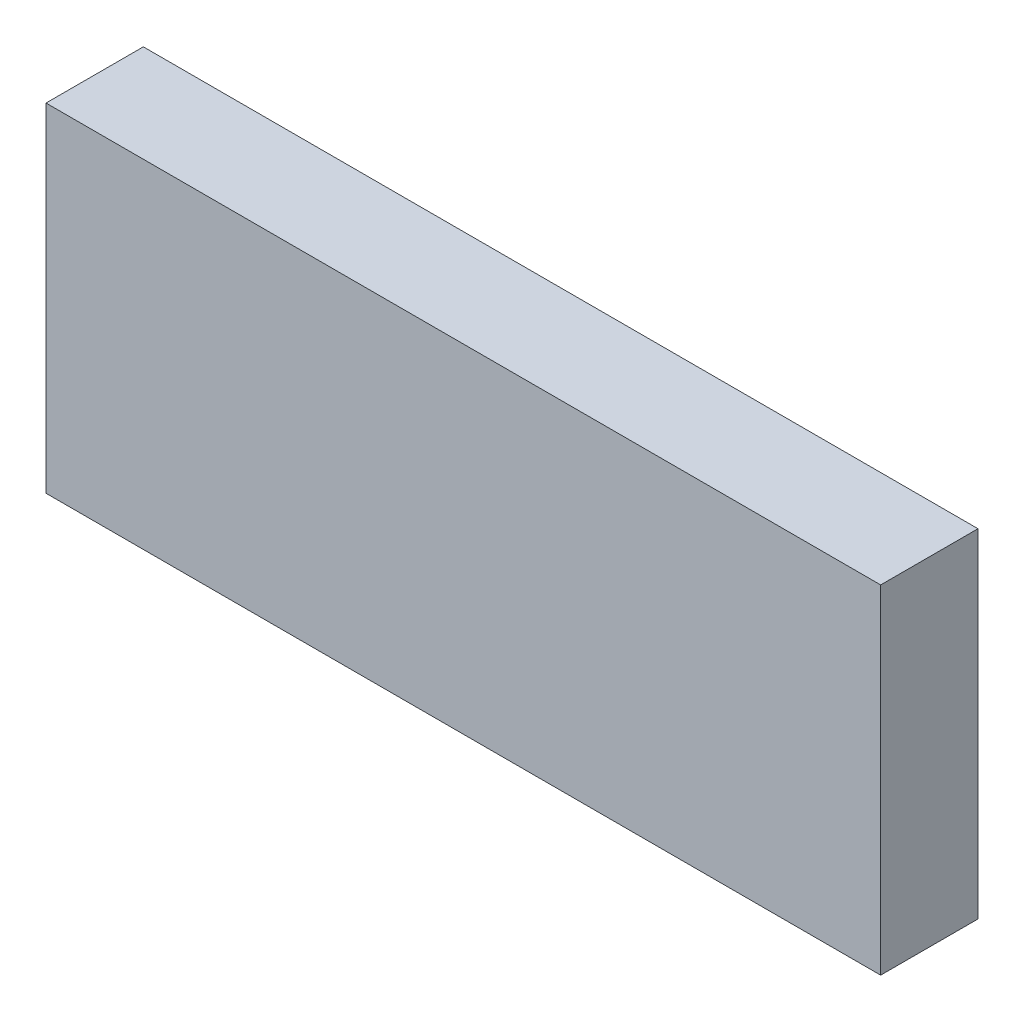
ISO-10303-21;
HEADER;
FILE_DESCRIPTION(('STEP AP214'),'2;1');
FILE_NAME('part.step','',(''),(''),'','','');
FILE_SCHEMA(('AUTOMOTIVE_DESIGN { 1 0 10303 214 1 1 1 1 }'));
ENDSEC;
DATA;
#1=APPLICATION_CONTEXT('core data for automotive mechanical design processes');
#2=APPLICATION_PROTOCOL_DEFINITION('international standard','automotive_design',2000,#1);
#3=PRODUCT_CONTEXT('',#1,'mechanical');
#4=PRODUCT('Part','Part','',(#3));
#5=PRODUCT_RELATED_PRODUCT_CATEGORY('part','',(#4));
#6=PRODUCT_DEFINITION_FORMATION('','',#4);
#7=PRODUCT_DEFINITION_CONTEXT('part definition',#1,'design');
#8=PRODUCT_DEFINITION('design','',#6,#7);
#9=PRODUCT_DEFINITION_SHAPE('','',#8);
#10=(LENGTH_UNIT() NAMED_UNIT(*) SI_UNIT(.MILLI.,.METRE.));
#11=(NAMED_UNIT(*) PLANE_ANGLE_UNIT() SI_UNIT($,.RADIAN.));
#12=(NAMED_UNIT(*) SI_UNIT($,.STERADIAN.) SOLID_ANGLE_UNIT());
#13=UNCERTAINTY_MEASURE_WITH_UNIT(LENGTH_MEASURE(1.E-05),#10,'distance_accuracy_value','');
#14=(GEOMETRIC_REPRESENTATION_CONTEXT(3) GLOBAL_UNCERTAINTY_ASSIGNED_CONTEXT((#13)) GLOBAL_UNIT_ASSIGNED_CONTEXT((#10,
#11,#12)) REPRESENTATION_CONTEXT('',''));
#15=CARTESIAN_POINT('',(0.,0.,0.));
#16=DIRECTION('',(0.,0.,1.));
#17=DIRECTION('',(1.,0.,0.));
#18=AXIS2_PLACEMENT_3D('',#15,#16,#17);
#19=CARTESIAN_POINT('',(1.5434945,-0.62500002,0.35999928));
#20=DIRECTION('',(0.,0.,1.));
#21=DIRECTION('',(1.,0.,0.));
#22=AXIS2_PLACEMENT_3D('',#19,#20,#21);
#23=PLANE('',#22);
#24=DIRECTION('',(0.,-1.,0.));
#25=VECTOR('',#24,1.);
#26=CARTESIAN_POINT('',(1.5434945,0.62500002,0.35999928));
#27=LINE('',#26,#25);
#28=CARTESIAN_POINT('',(1.5434945,0.62500002,0.35999928));
#29=VERTEX_POINT('',#28);
#30=CARTESIAN_POINT('',(1.5434945,-0.62500002,0.35999928));
#31=VERTEX_POINT('',#30);
#32=EDGE_CURVE('E27',#29,#31,#27,.T.);
#33=ORIENTED_EDGE('',*,*,#32,.F.);
#34=DIRECTION('',(1.,0.,0.));
#35=VECTOR('',#34,1.);
#36=CARTESIAN_POINT('',(-1.54349196,0.62500002,0.35999928));
#37=LINE('',#36,#35);
#38=CARTESIAN_POINT('',(-1.54349196,0.62500002,0.35999928));
#39=VERTEX_POINT('',#38);
#40=EDGE_CURVE('E79',#39,#29,#37,.T.);
#41=ORIENTED_EDGE('',*,*,#40,.F.);
#42=DIRECTION('',(0.,1.,0.));
#43=VECTOR('',#42,1.);
#44=CARTESIAN_POINT('',(-1.54349196,-0.62500002,0.35999928));
#45=LINE('',#44,#43);
#46=CARTESIAN_POINT('',(-1.54349196,-0.62500002,0.35999928));
#47=VERTEX_POINT('',#46);
#48=EDGE_CURVE('E73',#47,#39,#45,.T.);
#49=ORIENTED_EDGE('',*,*,#48,.F.);
#50=DIRECTION('',(-1.,0.,0.));
#51=VECTOR('',#50,1.);
#52=CARTESIAN_POINT('',(1.5434945,-0.62500002,0.35999928));
#53=LINE('',#52,#51);
#54=EDGE_CURVE('E76',#31,#47,#53,.T.);
#55=ORIENTED_EDGE('',*,*,#54,.F.);
#56=EDGE_LOOP('',(#33,#41,#49,#55));
#57=FACE_BOUND('',#56,.T.);
#58=ADVANCED_FACE('F17',(#57),#23,.T.);
#59=CARTESIAN_POINT('',(1.5434945,-0.62500002,0.));
#60=DIRECTION('',(0.,0.,1.));
#61=DIRECTION('',(1.,0.,0.));
#62=AXIS2_PLACEMENT_3D('',#59,#60,#61);
#63=PLANE('',#62);
#64=DIRECTION('',(-1.,0.,0.));
#65=VECTOR('',#64,1.);
#66=CARTESIAN_POINT('',(1.5434945,-0.62500002,0.));
#67=LINE('',#66,#65);
#68=CARTESIAN_POINT('',(1.5434945,-0.62500002,0.));
#69=VERTEX_POINT('',#68);
#70=CARTESIAN_POINT('',(-1.54349196,-0.62500002,0.));
#71=VERTEX_POINT('',#70);
#72=EDGE_CURVE('E85',#69,#71,#67,.T.);
#73=ORIENTED_EDGE('',*,*,#72,.T.);
#74=DIRECTION('',(0.,1.,0.));
#75=VECTOR('',#74,1.);
#76=CARTESIAN_POINT('',(-1.54349196,-0.62500002,0.));
#77=LINE('',#76,#75);
#78=CARTESIAN_POINT('',(-1.54349196,0.62500002,0.));
#79=VERTEX_POINT('',#78);
#80=EDGE_CURVE('E91',#71,#79,#77,.T.);
#81=ORIENTED_EDGE('',*,*,#80,.T.);
#82=DIRECTION('',(1.,0.,0.));
#83=VECTOR('',#82,1.);
#84=CARTESIAN_POINT('',(-1.54349196,0.62500002,0.));
#85=LINE('',#84,#83);
#86=CARTESIAN_POINT('',(1.5434945,0.62500002,0.));
#87=VERTEX_POINT('',#86);
#88=EDGE_CURVE('E107',#79,#87,#85,.T.);
#89=ORIENTED_EDGE('',*,*,#88,.T.);
#90=DIRECTION('',(0.,-1.,0.));
#91=VECTOR('',#90,1.);
#92=CARTESIAN_POINT('',(1.5434945,0.62500002,0.));
#93=LINE('',#92,#91);
#94=EDGE_CURVE('E11',#87,#69,#93,.T.);
#95=ORIENTED_EDGE('',*,*,#94,.T.);
#96=EDGE_LOOP('',(#73,#81,#89,#95));
#97=FACE_BOUND('',#96,.T.);
#98=ADVANCED_FACE('F125',(#97),#63,.F.);
#99=CARTESIAN_POINT('',(1.5434945,0.62500002,0.));
#100=DIRECTION('',(1.,0.,0.));
#101=DIRECTION('',(0.,1.,0.));
#102=AXIS2_PLACEMENT_3D('',#99,#100,#101);
#103=PLANE('',#102);
#104=DIRECTION('',(0.,0.,1.));
#105=VECTOR('',#104,1.);
#106=CARTESIAN_POINT('',(1.5434945,0.62500002,0.));
#107=LINE('',#106,#105);
#108=EDGE_CURVE('E20',#87,#29,#107,.T.);
#109=ORIENTED_EDGE('',*,*,#108,.T.);
#110=ORIENTED_EDGE('',*,*,#32,.T.);
#111=DIRECTION('',(0.,0.,1.));
#112=VECTOR('',#111,1.);
#113=CARTESIAN_POINT('',(1.5434945,-0.62500002,0.));
#114=LINE('',#113,#112);
#115=EDGE_CURVE('E95',#69,#31,#114,.T.);
#116=ORIENTED_EDGE('',*,*,#115,.F.);
#117=ORIENTED_EDGE('',*,*,#94,.F.);
#118=EDGE_LOOP('',(#109,#110,#116,#117));
#119=FACE_BOUND('',#118,.T.);
#120=ADVANCED_FACE('F126',(#119),#103,.T.);
#121=CARTESIAN_POINT('',(-1.54349196,0.62500002,0.));
#122=DIRECTION('',(0.,1.,0.));
#123=DIRECTION('',(1.,0.,0.));
#124=AXIS2_PLACEMENT_3D('',#121,#122,#123);
#125=PLANE('',#124);
#126=DIRECTION('',(0.,0.,1.));
#127=VECTOR('',#126,1.);
#128=CARTESIAN_POINT('',(-1.54349196,0.62500002,0.));
#129=LINE('',#128,#127);
#130=EDGE_CURVE('E84',#79,#39,#129,.T.);
#131=ORIENTED_EDGE('',*,*,#130,.T.);
#132=ORIENTED_EDGE('',*,*,#40,.T.);
#133=ORIENTED_EDGE('',*,*,#108,.F.);
#134=ORIENTED_EDGE('',*,*,#88,.F.);
#135=EDGE_LOOP('',(#131,#132,#133,#134));
#136=FACE_BOUND('',#135,.T.);
#137=ADVANCED_FACE('F128',(#136),#125,.T.);
#138=CARTESIAN_POINT('',(-1.54349196,-0.62500002,0.));
#139=DIRECTION('',(-1.,0.,0.));
#140=DIRECTION('',(0.,0.,1.));
#141=AXIS2_PLACEMENT_3D('',#138,#139,#140);
#142=PLANE('',#141);
#143=DIRECTION('',(0.,0.,1.));
#144=VECTOR('',#143,1.);
#145=CARTESIAN_POINT('',(-1.54349196,-0.62500002,0.));
#146=LINE('',#145,#144);
#147=EDGE_CURVE('E88',#71,#47,#146,.T.);
#148=ORIENTED_EDGE('',*,*,#147,.T.);
#149=ORIENTED_EDGE('',*,*,#48,.T.);
#150=ORIENTED_EDGE('',*,*,#130,.F.);
#151=ORIENTED_EDGE('',*,*,#80,.F.);
#152=EDGE_LOOP('',(#148,#149,#150,#151));
#153=FACE_BOUND('',#152,.T.);
#154=ADVANCED_FACE('F89',(#153),#142,.T.);
#155=CARTESIAN_POINT('',(1.5434945,-0.62500002,0.));
#156=DIRECTION('',(0.,-1.,0.));
#157=DIRECTION('',(0.,0.,-1.));
#158=AXIS2_PLACEMENT_3D('',#155,#156,#157);
#159=PLANE('',#158);
#160=ORIENTED_EDGE('',*,*,#115,.T.);
#161=ORIENTED_EDGE('',*,*,#54,.T.);
#162=ORIENTED_EDGE('',*,*,#147,.F.);
#163=ORIENTED_EDGE('',*,*,#72,.F.);
#164=EDGE_LOOP('',(#160,#161,#162,#163));
#165=FACE_BOUND('',#164,.T.);
#166=ADVANCED_FACE('F94',(#165),#159,.T.);
#167=CLOSED_SHELL('',(#58,#98,#120,#137,#154,#166));
#168=MANIFOLD_SOLID_BREP('B1',#167);
#169=ADVANCED_BREP_SHAPE_REPRESENTATION('',(#18,#168),#14);
#170=SHAPE_DEFINITION_REPRESENTATION(#9,#169);
ENDSEC;
END-ISO-10303-21;
